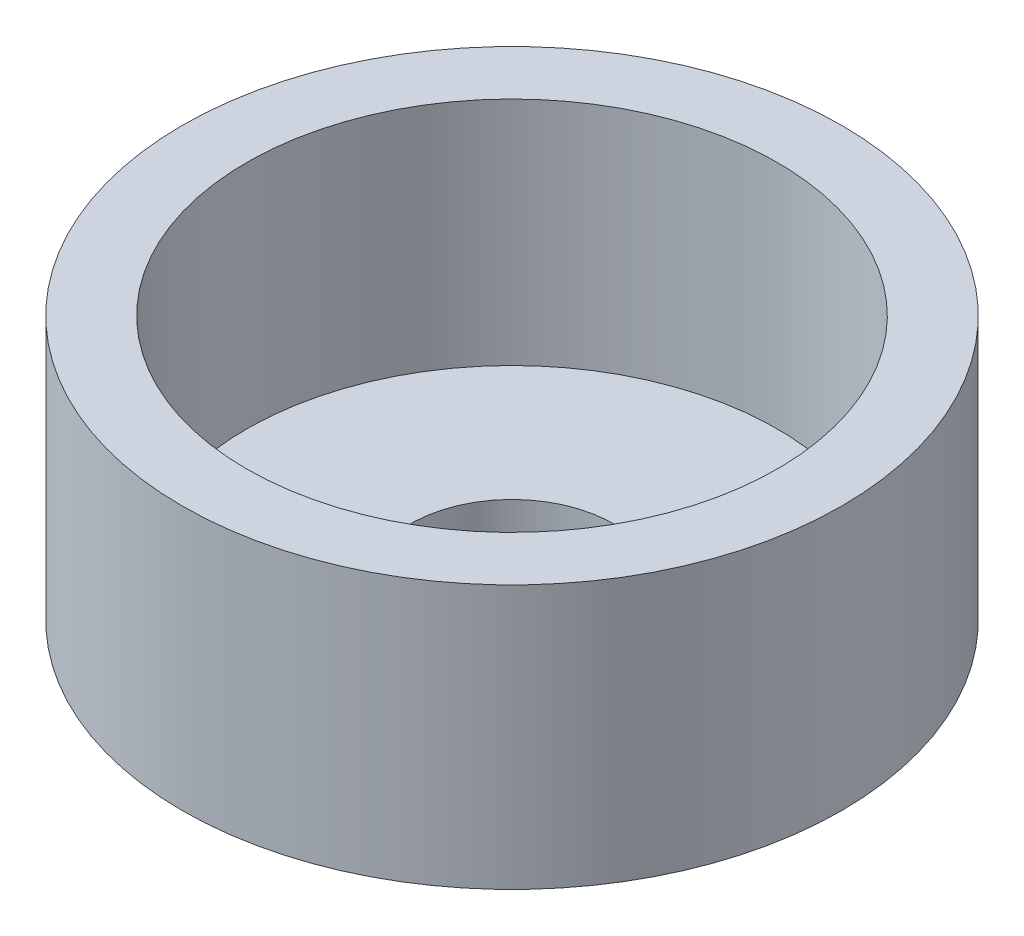
ISO-10303-21;
HEADER;
FILE_DESCRIPTION(('STEP AP214'),'2;1');
FILE_NAME('part.step','',(''),(''),'','','');
FILE_SCHEMA(('AUTOMOTIVE_DESIGN { 1 0 10303 214 1 1 1 1 }'));
ENDSEC;
DATA;
#1=APPLICATION_CONTEXT('core data for automotive mechanical design processes');
#2=APPLICATION_PROTOCOL_DEFINITION('international standard','automotive_design',2000,#1);
#3=PRODUCT_CONTEXT('',#1,'mechanical');
#4=PRODUCT('Part','Part','',(#3));
#5=PRODUCT_RELATED_PRODUCT_CATEGORY('part','',(#4));
#6=PRODUCT_DEFINITION_FORMATION('','',#4);
#7=PRODUCT_DEFINITION_CONTEXT('part definition',#1,'design');
#8=PRODUCT_DEFINITION('design','',#6,#7);
#9=PRODUCT_DEFINITION_SHAPE('','',#8);
#10=(LENGTH_UNIT() NAMED_UNIT(*) SI_UNIT(.MILLI.,.METRE.));
#11=(NAMED_UNIT(*) PLANE_ANGLE_UNIT() SI_UNIT($,.RADIAN.));
#12=(NAMED_UNIT(*) SI_UNIT($,.STERADIAN.) SOLID_ANGLE_UNIT());
#13=UNCERTAINTY_MEASURE_WITH_UNIT(LENGTH_MEASURE(1.E-05),#10,'distance_accuracy_value','');
#14=(GEOMETRIC_REPRESENTATION_CONTEXT(3) GLOBAL_UNCERTAINTY_ASSIGNED_CONTEXT((#13)) GLOBAL_UNIT_ASSIGNED_CONTEXT((#10,
#11,#12)) REPRESENTATION_CONTEXT('',''));
#15=CARTESIAN_POINT('',(0.,0.,0.));
#16=DIRECTION('',(0.,0.,1.));
#17=DIRECTION('',(1.,0.,0.));
#18=AXIS2_PLACEMENT_3D('',#15,#16,#17);
#19=CARTESIAN_POINT('',(0.,1.,0.));
#20=DIRECTION('',(0.,1.,0.));
#21=DIRECTION('',(0.,0.,1.));
#22=AXIS2_PLACEMENT_3D('',#19,#20,#21);
#23=PLANE('',#22);
#24=CARTESIAN_POINT('',(0.,1.,0.));
#25=DIRECTION('',(0.,1.,0.));
#26=DIRECTION('',(0.,0.,1.));
#27=AXIS2_PLACEMENT_3D('',#24,#25,#26);
#28=CIRCLE('',#27,3.075);
#29=CARTESIAN_POINT('',(0.,1.,3.075));
#30=VERTEX_POINT('',#29);
#31=EDGE_CURVE('E43',#30,#30,#28,.T.);
#32=ORIENTED_EDGE('',*,*,#31,.F.);
#33=EDGE_LOOP('',(#32));
#34=FACE_BOUND('',#33,.T.);
#35=CARTESIAN_POINT('',(0.,1.,0.));
#36=DIRECTION('',(0.,1.,0.));
#37=DIRECTION('',(0.,0.,1.));
#38=AXIS2_PLACEMENT_3D('',#35,#36,#37);
#39=CIRCLE('',#38,8.05);
#40=CARTESIAN_POINT('',(0.,1.,8.05));
#41=VERTEX_POINT('',#40);
#42=EDGE_CURVE('E10',#41,#41,#39,.F.);
#43=ORIENTED_EDGE('',*,*,#42,.F.);
#44=EDGE_LOOP('',(#43));
#45=FACE_BOUND('',#44,.T.);
#46=ADVANCED_FACE('F36',(#34,#45),#23,.T.);
#47=CARTESIAN_POINT('',(0.,1.,0.));
#48=DIRECTION('',(0.,-1.,0.));
#49=DIRECTION('',(0.,0.,-1.));
#50=AXIS2_PLACEMENT_3D('',#47,#48,#49);
#51=CYLINDRICAL_SURFACE('',#50,10.);
#52=CARTESIAN_POINT('',(0.,0.,0.));
#53=DIRECTION('',(0.,1.,0.));
#54=DIRECTION('',(0.,0.,1.));
#55=AXIS2_PLACEMENT_3D('',#52,#53,#54);
#56=CIRCLE('',#55,10.);
#57=CARTESIAN_POINT('',(0.,0.,10.));
#58=VERTEX_POINT('',#57);
#59=EDGE_CURVE('E52',#58,#58,#56,.T.);
#60=ORIENTED_EDGE('',*,*,#59,.T.);
#61=EDGE_LOOP('',(#60));
#62=FACE_BOUND('',#61,.T.);
#63=CARTESIAN_POINT('',(0.,8.,0.));
#64=DIRECTION('',(0.,1.,0.));
#65=DIRECTION('',(0.,0.,1.));
#66=AXIS2_PLACEMENT_3D('',#63,#64,#65);
#67=CIRCLE('',#66,10.);
#68=CARTESIAN_POINT('',(0.,8.,10.));
#69=VERTEX_POINT('',#68);
#70=EDGE_CURVE('E55',#69,#69,#67,.T.);
#71=ORIENTED_EDGE('',*,*,#70,.F.);
#72=EDGE_LOOP('',(#71));
#73=FACE_BOUND('',#72,.T.);
#74=ADVANCED_FACE('F38',(#62,#73),#51,.T.);
#75=CARTESIAN_POINT('',(0.,1.,0.));
#76=DIRECTION('',(0.,-1.,0.));
#77=DIRECTION('',(0.,0.,-1.));
#78=AXIS2_PLACEMENT_3D('',#75,#76,#77);
#79=CYLINDRICAL_SURFACE('',#78,3.075);
#80=ORIENTED_EDGE('',*,*,#31,.T.);
#81=EDGE_LOOP('',(#80));
#82=FACE_BOUND('',#81,.T.);
#83=CARTESIAN_POINT('',(0.,0.,0.));
#84=DIRECTION('',(0.,1.,0.));
#85=DIRECTION('',(0.,0.,1.));
#86=AXIS2_PLACEMENT_3D('',#83,#84,#85);
#87=CIRCLE('',#86,3.075);
#88=CARTESIAN_POINT('',(0.,0.,3.075));
#89=VERTEX_POINT('',#88);
#90=EDGE_CURVE('E47',#89,#89,#87,.T.);
#91=ORIENTED_EDGE('',*,*,#90,.F.);
#92=EDGE_LOOP('',(#91));
#93=FACE_BOUND('',#92,.T.);
#94=ADVANCED_FACE('F78',(#82,#93),#79,.F.);
#95=CARTESIAN_POINT('',(0.,0.,0.));
#96=DIRECTION('',(0.,1.,0.));
#97=DIRECTION('',(0.,0.,1.));
#98=AXIS2_PLACEMENT_3D('',#95,#96,#97);
#99=PLANE('',#98);
#100=ORIENTED_EDGE('',*,*,#59,.F.);
#101=EDGE_LOOP('',(#100));
#102=FACE_BOUND('',#101,.T.);
#103=ORIENTED_EDGE('',*,*,#90,.T.);
#104=EDGE_LOOP('',(#103));
#105=FACE_BOUND('',#104,.T.);
#106=ADVANCED_FACE('F71',(#102,#105),#99,.F.);
#107=CARTESIAN_POINT('',(0.,8.,0.));
#108=DIRECTION('',(0.,1.,0.));
#109=DIRECTION('',(0.,0.,1.));
#110=AXIS2_PLACEMENT_3D('',#107,#108,#109);
#111=PLANE('',#110);
#112=ORIENTED_EDGE('',*,*,#70,.T.);
#113=EDGE_LOOP('',(#112));
#114=FACE_BOUND('',#113,.T.);
#115=CARTESIAN_POINT('',(0.,8.,0.));
#116=DIRECTION('',(0.,1.,0.));
#117=DIRECTION('',(0.,0.,1.));
#118=AXIS2_PLACEMENT_3D('',#115,#116,#117);
#119=CIRCLE('',#118,8.05);
#120=CARTESIAN_POINT('',(0.,8.,8.05));
#121=VERTEX_POINT('',#120);
#122=EDGE_CURVE('E61',#121,#121,#119,.T.);
#123=ORIENTED_EDGE('',*,*,#122,.F.);
#124=EDGE_LOOP('',(#123));
#125=FACE_BOUND('',#124,.T.);
#126=ADVANCED_FACE('F69',(#114,#125),#111,.T.);
#127=CARTESIAN_POINT('',(0.,8.,0.));
#128=DIRECTION('',(0.,-1.,0.));
#129=DIRECTION('',(0.,0.,-1.));
#130=AXIS2_PLACEMENT_3D('',#127,#128,#129);
#131=CYLINDRICAL_SURFACE('',#130,8.05);
#132=ORIENTED_EDGE('',*,*,#122,.T.);
#133=EDGE_LOOP('',(#132));
#134=FACE_BOUND('',#133,.T.);
#135=ORIENTED_EDGE('',*,*,#42,.T.);
#136=EDGE_LOOP('',(#135));
#137=FACE_BOUND('',#136,.T.);
#138=ADVANCED_FACE('F67',(#134,#137),#131,.F.);
#139=CLOSED_SHELL('',(#46,#74,#94,#106,#126,#138));
#140=MANIFOLD_SOLID_BREP('B2',#139);
#141=ADVANCED_BREP_SHAPE_REPRESENTATION('',(#18,#140),#14);
#142=SHAPE_DEFINITION_REPRESENTATION(#9,#141);
ENDSEC;
END-ISO-10303-21;
